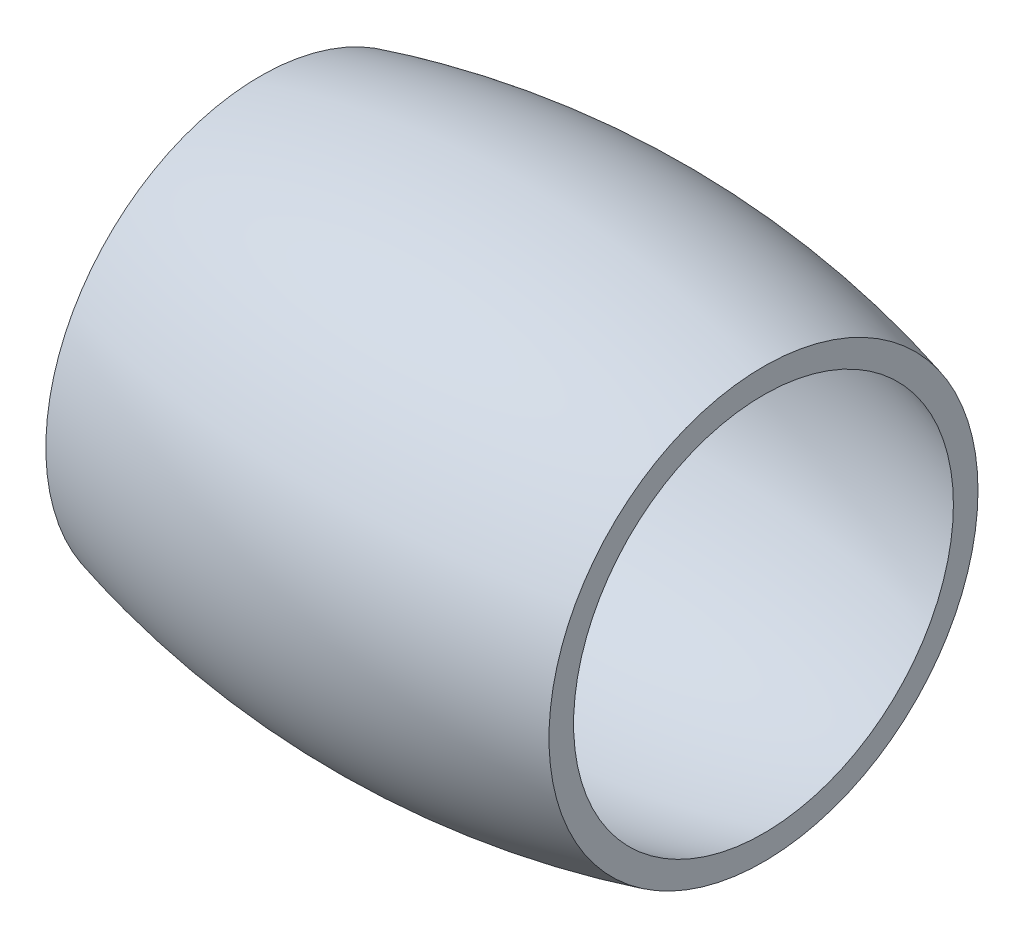
ISO-10303-21;
HEADER;
FILE_DESCRIPTION(('STEP AP214'),'2;1');
FILE_NAME('part.step','',(''),(''),'','','');
FILE_SCHEMA(('AUTOMOTIVE_DESIGN { 1 0 10303 214 1 1 1 1 }'));
ENDSEC;
DATA;
#1=APPLICATION_CONTEXT('core data for automotive mechanical design processes');
#2=APPLICATION_PROTOCOL_DEFINITION('international standard','automotive_design',2000,#1);
#3=PRODUCT_CONTEXT('',#1,'mechanical');
#4=PRODUCT('Part','Part','',(#3));
#5=PRODUCT_RELATED_PRODUCT_CATEGORY('part','',(#4));
#6=PRODUCT_DEFINITION_FORMATION('','',#4);
#7=PRODUCT_DEFINITION_CONTEXT('part definition',#1,'design');
#8=PRODUCT_DEFINITION('design','',#6,#7);
#9=PRODUCT_DEFINITION_SHAPE('','',#8);
#10=(LENGTH_UNIT() NAMED_UNIT(*) SI_UNIT(.MILLI.,.METRE.));
#11=(NAMED_UNIT(*) PLANE_ANGLE_UNIT() SI_UNIT($,.RADIAN.));
#12=(NAMED_UNIT(*) SI_UNIT($,.STERADIAN.) SOLID_ANGLE_UNIT());
#13=UNCERTAINTY_MEASURE_WITH_UNIT(LENGTH_MEASURE(1.E-05),#10,'distance_accuracy_value','');
#14=(GEOMETRIC_REPRESENTATION_CONTEXT(3) GLOBAL_UNCERTAINTY_ASSIGNED_CONTEXT((#13)) GLOBAL_UNIT_ASSIGNED_CONTEXT((#10,
#11,#12)) REPRESENTATION_CONTEXT('',''));
#15=CARTESIAN_POINT('',(0.,0.,0.));
#16=DIRECTION('',(0.,0.,1.));
#17=DIRECTION('',(1.,0.,0.));
#18=AXIS2_PLACEMENT_3D('',#15,#16,#17);
#19=CARTESIAN_POINT('',(0.,0.,0.));
#20=DIRECTION('',(1.,0.,0.));
#21=DIRECTION('',(0.,0.,-1.));
#22=AXIS2_PLACEMENT_3D('',#19,#20,#21);
#23=DEGENERATE_TOROIDAL_SURFACE('',#22,48.4401980839499,63.4125,.F.);
#24=CARTESIAN_POINT('',(16.8232379316637,0.,0.));
#25=DIRECTION('',(1.,0.,0.));
#26=DIRECTION('',(0.,0.,-1.));
#27=AXIS2_PLACEMENT_3D('',#24,#25,#26);
#28=CIRCLE('',#27,12.7);
#29=CARTESIAN_POINT('',(16.8232379316637,0.,-12.7));
#30=VERTEX_POINT('',#29);
#31=EDGE_CURVE('E10',#30,#30,#28,.T.);
#32=ORIENTED_EDGE('',*,*,#31,.T.);
#33=EDGE_LOOP('',(#32));
#34=FACE_BOUND('',#33,.T.);
#35=CARTESIAN_POINT('',(-16.8232379316637,0.,0.));
#36=DIRECTION('',(1.,0.,0.));
#37=DIRECTION('',(0.,0.,-1.));
#38=AXIS2_PLACEMENT_3D('',#35,#36,#37);
#39=CIRCLE('',#38,12.7);
#40=CARTESIAN_POINT('',(-16.8232379316637,0.,-12.7));
#41=VERTEX_POINT('',#40);
#42=EDGE_CURVE('E44',#41,#41,#39,.T.);
#43=ORIENTED_EDGE('',*,*,#42,.F.);
#44=EDGE_LOOP('',(#43));
#45=FACE_BOUND('',#44,.T.);
#46=ADVANCED_FACE('F30',(#34,#45),#23,.T.);
#47=CARTESIAN_POINT('',(16.8232379316637,12.7,0.));
#48=DIRECTION('',(1.,0.,0.));
#49=DIRECTION('',(0.,0.,-1.));
#50=AXIS2_PLACEMENT_3D('',#47,#48,#49);
#51=PLANE('',#50);
#52=CARTESIAN_POINT('',(16.8232379316637,0.,0.));
#53=DIRECTION('',(1.,0.,0.));
#54=DIRECTION('',(0.,0.,-1.));
#55=AXIS2_PLACEMENT_3D('',#52,#53,#54);
#56=CIRCLE('',#55,14.3449806248396);
#57=CARTESIAN_POINT('',(16.8232379316637,0.,-14.3449806248396));
#58=VERTEX_POINT('',#57);
#59=EDGE_CURVE('E36',#58,#58,#56,.T.);
#60=ORIENTED_EDGE('',*,*,#59,.T.);
#61=EDGE_LOOP('',(#60));
#62=FACE_BOUND('',#61,.T.);
#63=ORIENTED_EDGE('',*,*,#31,.F.);
#64=EDGE_LOOP('',(#63));
#65=FACE_BOUND('',#64,.T.);
#66=ADVANCED_FACE('F54',(#62,#65),#51,.T.);
#67=CARTESIAN_POINT('',(0.,0.,0.));
#68=DIRECTION('',(1.,0.,0.));
#69=DIRECTION('',(0.,0.,-1.));
#70=AXIS2_PLACEMENT_3D('',#67,#68,#69);
#71=DEGENERATE_TOROIDAL_SURFACE('',#70,48.4401980839499,65.,.F.);
#72=CARTESIAN_POINT('',(-16.8232379316637,0.,0.));
#73=DIRECTION('',(1.,0.,0.));
#74=DIRECTION('',(0.,0.,-1.));
#75=AXIS2_PLACEMENT_3D('',#72,#73,#74);
#76=CIRCLE('',#75,14.3449806248396);
#77=CARTESIAN_POINT('',(-16.8232379316637,0.,-14.3449806248396));
#78=VERTEX_POINT('',#77);
#79=EDGE_CURVE('E40',#78,#78,#76,.T.);
#80=ORIENTED_EDGE('',*,*,#79,.T.);
#81=EDGE_LOOP('',(#80));
#82=FACE_BOUND('',#81,.T.);
#83=ORIENTED_EDGE('',*,*,#59,.F.);
#84=EDGE_LOOP('',(#83));
#85=FACE_BOUND('',#84,.T.);
#86=ADVANCED_FACE('F58',(#82,#85),#71,.F.);
#87=CARTESIAN_POINT('',(-16.8232379316637,12.7,0.));
#88=DIRECTION('',(-1.,0.,0.));
#89=DIRECTION('',(0.,0.,1.));
#90=AXIS2_PLACEMENT_3D('',#87,#88,#89);
#91=PLANE('',#90);
#92=ORIENTED_EDGE('',*,*,#42,.T.);
#93=EDGE_LOOP('',(#92));
#94=FACE_BOUND('',#93,.T.);
#95=ORIENTED_EDGE('',*,*,#79,.F.);
#96=EDGE_LOOP('',(#95));
#97=FACE_BOUND('',#96,.T.);
#98=ADVANCED_FACE('F50',(#94,#97),#91,.T.);
#99=CLOSED_SHELL('',(#46,#66,#86,#98));
#100=MANIFOLD_SOLID_BREP('B2',#99);
#101=ADVANCED_BREP_SHAPE_REPRESENTATION('',(#18,#100),#14);
#102=SHAPE_DEFINITION_REPRESENTATION(#9,#101);
ENDSEC;
END-ISO-10303-21;
